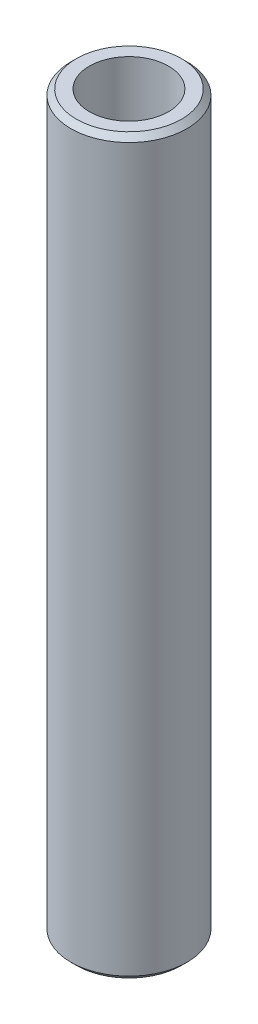
ISO-10303-21;
HEADER;
FILE_DESCRIPTION(('STEP AP214'),'2;1');
FILE_NAME('part.step','',(''),(''),'','','');
FILE_SCHEMA(('AUTOMOTIVE_DESIGN { 1 0 10303 214 1 1 1 1 }'));
ENDSEC;
DATA;
#1=APPLICATION_CONTEXT('core data for automotive mechanical design processes');
#2=APPLICATION_PROTOCOL_DEFINITION('international standard','automotive_design',2000,#1);
#3=PRODUCT_CONTEXT('',#1,'mechanical');
#4=PRODUCT('Part','Part','',(#3));
#5=PRODUCT_RELATED_PRODUCT_CATEGORY('part','',(#4));
#6=PRODUCT_DEFINITION_FORMATION('','',#4);
#7=PRODUCT_DEFINITION_CONTEXT('part definition',#1,'design');
#8=PRODUCT_DEFINITION('design','',#6,#7);
#9=PRODUCT_DEFINITION_SHAPE('','',#8);
#10=(LENGTH_UNIT() NAMED_UNIT(*) SI_UNIT(.MILLI.,.METRE.));
#11=(NAMED_UNIT(*) PLANE_ANGLE_UNIT() SI_UNIT($,.RADIAN.));
#12=(NAMED_UNIT(*) SI_UNIT($,.STERADIAN.) SOLID_ANGLE_UNIT());
#13=UNCERTAINTY_MEASURE_WITH_UNIT(LENGTH_MEASURE(1.E-05),#10,'distance_accuracy_value','');
#14=(GEOMETRIC_REPRESENTATION_CONTEXT(3) GLOBAL_UNCERTAINTY_ASSIGNED_CONTEXT((#13)) GLOBAL_UNIT_ASSIGNED_CONTEXT((#10,
#11,#12)) REPRESENTATION_CONTEXT('',''));
#15=CARTESIAN_POINT('',(0.,0.,0.));
#16=DIRECTION('',(0.,0.,1.));
#17=DIRECTION('',(1.,0.,0.));
#18=AXIS2_PLACEMENT_3D('',#15,#16,#17);
#19=CARTESIAN_POINT('',(0.,600.,0.));
#20=DIRECTION('',(0.,-1.,0.));
#21=DIRECTION('',(0.,0.,-1.));
#22=AXIS2_PLACEMENT_3D('',#19,#20,#21);
#23=CYLINDRICAL_SURFACE('',#22,47.5);
#24=CARTESIAN_POINT('',(0.,595.525181377756,0.));
#25=DIRECTION('',(0.,1.,0.));
#26=DIRECTION('',(0.,0.,1.));
#27=AXIS2_PLACEMENT_3D('',#24,#25,#26);
#28=CIRCLE('',#27,47.5);
#29=CARTESIAN_POINT('',(0.,595.525181377756,47.5));
#30=VERTEX_POINT('',#29);
#31=EDGE_CURVE('E50',#30,#30,#28,.F.);
#32=ORIENTED_EDGE('',*,*,#31,.T.);
#33=EDGE_LOOP('',(#32));
#34=FACE_BOUND('',#33,.T.);
#35=CARTESIAN_POINT('',(0.,4.47481862224364,0.));
#36=DIRECTION('',(0.,1.,0.));
#37=DIRECTION('',(0.,0.,1.));
#38=AXIS2_PLACEMENT_3D('',#35,#36,#37);
#39=CIRCLE('',#38,47.5);
#40=CARTESIAN_POINT('',(0.,4.47481862224364,47.5));
#41=VERTEX_POINT('',#40);
#42=EDGE_CURVE('E51',#41,#41,#39,.T.);
#43=ORIENTED_EDGE('',*,*,#42,.T.);
#44=EDGE_LOOP('',(#43));
#45=FACE_BOUND('',#44,.T.);
#46=ADVANCED_FACE('F39',(#34,#45),#23,.T.);
#47=CARTESIAN_POINT('',(0.,600.,0.));
#48=DIRECTION('',(0.,1.,0.));
#49=DIRECTION('',(0.,0.,1.));
#50=AXIS2_PLACEMENT_3D('',#47,#48,#49);
#51=PLANE('',#50);
#52=CARTESIAN_POINT('',(0.,600.,0.));
#53=DIRECTION('',(0.,1.,0.));
#54=DIRECTION('',(0.,0.,1.));
#55=AXIS2_PLACEMENT_3D('',#52,#53,#54);
#56=CIRCLE('',#55,43.0251813777564);
#57=CARTESIAN_POINT('',(0.,600.,43.0251813777564));
#58=VERTEX_POINT('',#57);
#59=EDGE_CURVE('E54',#58,#58,#56,.T.);
#60=ORIENTED_EDGE('',*,*,#59,.T.);
#61=EDGE_LOOP('',(#60));
#62=FACE_BOUND('',#61,.T.);
#63=CARTESIAN_POINT('',(0.,600.,0.));
#64=DIRECTION('',(0.,1.,0.));
#65=DIRECTION('',(0.,0.,1.));
#66=AXIS2_PLACEMENT_3D('',#63,#64,#65);
#67=CIRCLE('',#66,32.4012001107666);
#68=CARTESIAN_POINT('',(0.,600.,32.4012001107666));
#69=VERTEX_POINT('',#68);
#70=EDGE_CURVE('E58',#69,#69,#67,.T.);
#71=ORIENTED_EDGE('',*,*,#70,.F.);
#72=EDGE_LOOP('',(#71));
#73=FACE_BOUND('',#72,.T.);
#74=ADVANCED_FACE('F69',(#62,#73),#51,.T.);
#75=CARTESIAN_POINT('',(0.,0.,0.));
#76=DIRECTION('',(0.,1.,0.));
#77=DIRECTION('',(0.,0.,1.));
#78=AXIS2_PLACEMENT_3D('',#75,#76,#77);
#79=PLANE('',#78);
#80=CARTESIAN_POINT('',(0.,0.,0.));
#81=DIRECTION('',(0.,1.,0.));
#82=DIRECTION('',(0.,0.,1.));
#83=AXIS2_PLACEMENT_3D('',#80,#81,#82);
#84=CIRCLE('',#83,43.0251813777563);
#85=CARTESIAN_POINT('',(0.,0.,43.0251813777563));
#86=VERTEX_POINT('',#85);
#87=EDGE_CURVE('E10',#86,#86,#84,.F.);
#88=ORIENTED_EDGE('',*,*,#87,.T.);
#89=EDGE_LOOP('',(#88));
#90=FACE_BOUND('',#89,.T.);
#91=CARTESIAN_POINT('',(0.,0.,0.));
#92=DIRECTION('',(0.,1.,0.));
#93=DIRECTION('',(0.,0.,1.));
#94=AXIS2_PLACEMENT_3D('',#91,#92,#93);
#95=CIRCLE('',#94,32.4012001107666);
#96=CARTESIAN_POINT('',(0.,0.,32.4012001107666));
#97=VERTEX_POINT('',#96);
#98=EDGE_CURVE('E63',#97,#97,#95,.T.);
#99=ORIENTED_EDGE('',*,*,#98,.T.);
#100=EDGE_LOOP('',(#99));
#101=FACE_BOUND('',#100,.T.);
#102=ADVANCED_FACE('F75',(#90,#101),#79,.F.);
#103=CARTESIAN_POINT('',(0.,600.,0.));
#104=DIRECTION('',(0.,-1.,0.));
#105=DIRECTION('',(0.,0.,-1.));
#106=AXIS2_PLACEMENT_3D('',#103,#104,#105);
#107=CYLINDRICAL_SURFACE('',#106,32.4012001107666);
#108=ORIENTED_EDGE('',*,*,#70,.T.);
#109=EDGE_LOOP('',(#108));
#110=FACE_BOUND('',#109,.T.);
#111=ORIENTED_EDGE('',*,*,#98,.F.);
#112=EDGE_LOOP('',(#111));
#113=FACE_BOUND('',#112,.T.);
#114=ADVANCED_FACE('F70',(#110,#113),#107,.F.);
#115=CARTESIAN_POINT('',(0.,600.,0.));
#116=DIRECTION('',(0.,-1.,0.));
#117=DIRECTION('',(0.,0.,-1.));
#118=AXIS2_PLACEMENT_3D('',#115,#116,#117);
#119=CONICAL_SURFACE('',#118,43.0251813777564,0.785398163397445);
#120=ORIENTED_EDGE('',*,*,#31,.F.);
#121=EDGE_LOOP('',(#120));
#122=FACE_BOUND('',#121,.T.);
#123=ORIENTED_EDGE('',*,*,#59,.F.);
#124=EDGE_LOOP('',(#123));
#125=FACE_BOUND('',#124,.T.);
#126=ADVANCED_FACE('F81',(#122,#125),#119,.T.);
#127=CARTESIAN_POINT('',(0.,4.47481862224364,0.));
#128=DIRECTION('',(0.,1.,0.));
#129=DIRECTION('',(0.,0.,1.));
#130=AXIS2_PLACEMENT_3D('',#127,#128,#129);
#131=CONICAL_SURFACE('',#130,47.5,0.785398163397457);
#132=ORIENTED_EDGE('',*,*,#87,.F.);
#133=EDGE_LOOP('',(#132));
#134=FACE_BOUND('',#133,.T.);
#135=ORIENTED_EDGE('',*,*,#42,.F.);
#136=EDGE_LOOP('',(#135));
#137=FACE_BOUND('',#136,.T.);
#138=ADVANCED_FACE('F45',(#134,#137),#131,.T.);
#139=CLOSED_SHELL('',(#46,#74,#102,#114,#126,#138));
#140=MANIFOLD_SOLID_BREP('B2',#139);
#141=ADVANCED_BREP_SHAPE_REPRESENTATION('',(#18,#140),#14);
#142=SHAPE_DEFINITION_REPRESENTATION(#9,#141);
ENDSEC;
END-ISO-10303-21;
